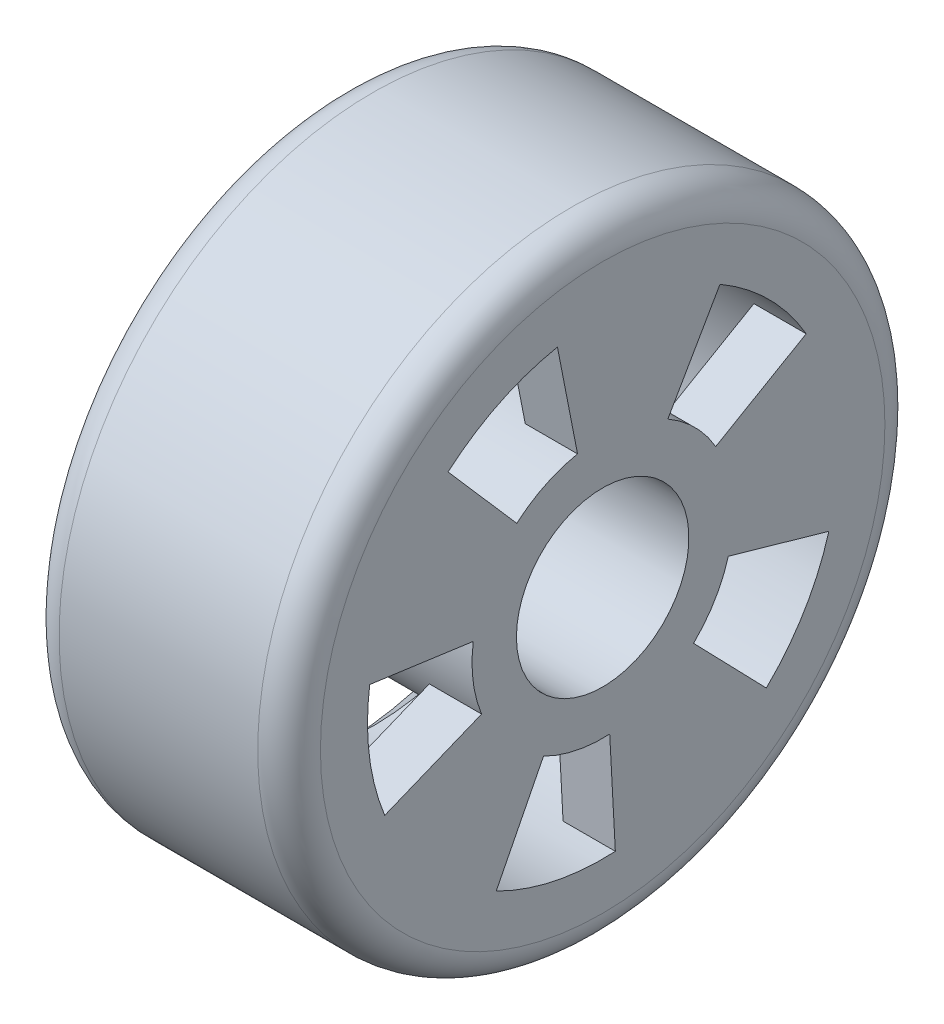
ISO-10303-21;
HEADER;
FILE_DESCRIPTION(('STEP AP214'),'2;1');
FILE_NAME('part.step','',(''),(''),'','','');
FILE_SCHEMA(('AUTOMOTIVE_DESIGN { 1 0 10303 214 1 1 1 1 }'));
ENDSEC;
DATA;
#1=APPLICATION_CONTEXT('core data for automotive mechanical design processes');
#2=APPLICATION_PROTOCOL_DEFINITION('international standard','automotive_design',2000,#1);
#3=PRODUCT_CONTEXT('',#1,'mechanical');
#4=PRODUCT('Part','Part','',(#3));
#5=PRODUCT_RELATED_PRODUCT_CATEGORY('part','',(#4));
#6=PRODUCT_DEFINITION_FORMATION('','',#4);
#7=PRODUCT_DEFINITION_CONTEXT('part definition',#1,'design');
#8=PRODUCT_DEFINITION('design','',#6,#7);
#9=PRODUCT_DEFINITION_SHAPE('','',#8);
#10=(LENGTH_UNIT() NAMED_UNIT(*) SI_UNIT(.MILLI.,.METRE.));
#11=(NAMED_UNIT(*) PLANE_ANGLE_UNIT() SI_UNIT($,.RADIAN.));
#12=(NAMED_UNIT(*) SI_UNIT($,.STERADIAN.) SOLID_ANGLE_UNIT());
#13=UNCERTAINTY_MEASURE_WITH_UNIT(LENGTH_MEASURE(1.E-05),#10,'distance_accuracy_value','');
#14=(GEOMETRIC_REPRESENTATION_CONTEXT(3) GLOBAL_UNCERTAINTY_ASSIGNED_CONTEXT((#13)) GLOBAL_UNIT_ASSIGNED_CONTEXT((#10,
#11,#12)) REPRESENTATION_CONTEXT('',''));
#15=CARTESIAN_POINT('',(0.,0.,0.));
#16=DIRECTION('',(0.,0.,1.));
#17=DIRECTION('',(1.,0.,0.));
#18=AXIS2_PLACEMENT_3D('',#15,#16,#17);
#19=CARTESIAN_POINT('',(25.,0.,0.));
#20=DIRECTION('',(-1.,0.,0.));
#21=DIRECTION('',(0.,0.,1.));
#22=AXIS2_PLACEMENT_3D('',#19,#20,#21);
#23=CYLINDRICAL_SURFACE('',#22,8.25);
#24=CARTESIAN_POINT('',(25.,0.,0.));
#25=DIRECTION('',(-1.,0.,0.));
#26=DIRECTION('',(0.,0.,1.));
#27=AXIS2_PLACEMENT_3D('',#24,#25,#26);
#28=CIRCLE('',#27,8.25);
#29=CARTESIAN_POINT('',(25.,0.,8.25));
#30=VERTEX_POINT('',#29);
#31=EDGE_CURVE('E521',#30,#30,#28,.T.);
#32=ORIENTED_EDGE('',*,*,#31,.F.);
#33=EDGE_LOOP('',(#32));
#34=FACE_BOUND('',#33,.T.);
#35=CARTESIAN_POINT('',(8.,0.,0.));
#36=DIRECTION('',(-1.,0.,0.));
#37=DIRECTION('',(0.,0.,1.));
#38=AXIS2_PLACEMENT_3D('',#35,#36,#37);
#39=CIRCLE('',#38,8.25);
#40=CARTESIAN_POINT('',(8.,0.,8.25));
#41=VERTEX_POINT('',#40);
#42=EDGE_CURVE('E11',#41,#41,#39,.F.);
#43=ORIENTED_EDGE('',*,*,#42,.F.);
#44=EDGE_LOOP('',(#43));
#45=FACE_BOUND('',#44,.T.);
#46=ADVANCED_FACE('F45',(#34,#45),#23,.F.);
#47=CARTESIAN_POINT('',(20.,0.,0.));
#48=DIRECTION('',(-1.,0.,0.));
#49=DIRECTION('',(0.,0.,1.));
#50=AXIS2_PLACEMENT_3D('',#47,#48,#49);
#51=PLANE('',#50);
#52=DIRECTION('',(0.,0.376047972262879,-0.926600195638322));
#53=VECTOR('',#52,1.);
#54=CARTESIAN_POINT('',(20.,0.,0.));
#55=LINE('',#54,#53);
#56=CARTESIAN_POINT('',(20.,-8.46107937591478,20.8485044018623));
#57=VERTEX_POINT('',#56);
#58=CARTESIAN_POINT('',(20.,-4.70059965328599,11.582502445479));
#59=VERTEX_POINT('',#58);
#60=EDGE_CURVE('E202',#57,#59,#55,.T.);
#61=ORIENTED_EDGE('',*,*,#60,.T.);
#62=CARTESIAN_POINT('',(20.,0.,0.));
#63=DIRECTION('',(-1.,0.,0.));
#64=DIRECTION('',(0.,0.,1.));
#65=AXIS2_PLACEMENT_3D('',#62,#63,#64);
#66=CIRCLE('',#65,12.5);
#67=CARTESIAN_POINT('',(20.,-11.146392898788,5.6575547143487));
#68=VERTEX_POINT('',#67);
#69=EDGE_CURVE('E215',#68,#59,#66,.T.);
#70=ORIENTED_EDGE('',*,*,#69,.F.);
#71=DIRECTION('',(0.,-0.891711431903038,0.452604377147895));
#72=VECTOR('',#71,1.);
#73=CARTESIAN_POINT('',(20.,0.,0.));
#74=LINE('',#73,#72);
#75=CARTESIAN_POINT('',(20.,-20.0635072178184,10.1835984858276));
#76=VERTEX_POINT('',#75);
#77=EDGE_CURVE('E333',#68,#76,#74,.T.);
#78=ORIENTED_EDGE('',*,*,#77,.T.);
#79=CARTESIAN_POINT('',(20.,0.,0.));
#80=DIRECTION('',(-1.,0.,0.));
#81=DIRECTION('',(0.,0.,1.));
#82=AXIS2_PLACEMENT_3D('',#79,#80,#81);
#83=CIRCLE('',#82,22.5);
#84=EDGE_CURVE('E417',#76,#57,#83,.T.);
#85=ORIENTED_EDGE('',*,*,#84,.T.);
#86=EDGE_LOOP('',(#61,#70,#78,#85));
#87=FACE_BOUND('',#86,.T.);
#88=ADVANCED_FACE('F443',(#87),#51,.T.);
#89=DIRECTION('',(0.,0.998546941446976,0.053888827477402));
#90=VECTOR('',#89,1.);
#91=CARTESIAN_POINT('',(20.,0.,0.));
#92=LINE('',#91,#90);
#93=CARTESIAN_POINT('',(20.,-22.467306182557,-1.21249861824155));
#94=VERTEX_POINT('',#93);
#95=CARTESIAN_POINT('',(20.,-12.4818367680872,-0.673610343467527));
#96=VERTEX_POINT('',#95);
#97=EDGE_CURVE('E337',#94,#96,#92,.T.);
#98=ORIENTED_EDGE('',*,*,#97,.T.);
#99=CARTESIAN_POINT('',(20.,-8.97823363979892,-8.69720188964147));
#100=VERTEX_POINT('',#99);
#101=EDGE_CURVE('E217',#100,#96,#66,.T.);
#102=ORIENTED_EDGE('',*,*,#101,.F.);
#103=DIRECTION('',(0.,-0.718258691183913,-0.695776151171318));
#104=VECTOR('',#103,1.);
#105=CARTESIAN_POINT('',(20.,0.,0.));
#106=LINE('',#105,#104);
#107=CARTESIAN_POINT('',(20.,-16.160820551638,-15.6549634013546));
#108=VERTEX_POINT('',#107);
#109=EDGE_CURVE('E242',#100,#108,#106,.T.);
#110=ORIENTED_EDGE('',*,*,#109,.T.);
#111=EDGE_CURVE('E386',#108,#94,#83,.T.);
#112=ORIENTED_EDGE('',*,*,#111,.T.);
#113=EDGE_LOOP('',(#98,#102,#110,#112));
#114=FACE_BOUND('',#113,.T.);
#115=ADVANCED_FACE('F449',(#114),#51,.T.);
#116=DIRECTION('',(0.,0.274142197468578,0.961689167853678));
#117=VECTOR('',#116,1.);
#118=CARTESIAN_POINT('',(20.,0.,0.));
#119=LINE('',#118,#117);
#120=CARTESIAN_POINT('',(20.,-6.16819944304301,-21.6380062767077));
#121=VERTEX_POINT('',#120);
#122=CARTESIAN_POINT('',(20.,-3.42677746835723,-12.021114598171));
#123=VERTEX_POINT('',#122);
#124=EDGE_CURVE('E329',#121,#123,#119,.T.);
#125=ORIENTED_EDGE('',*,*,#124,.T.);
#126=CARTESIAN_POINT('',(20.,6.2668265228017,-10.8155852977594));
#127=VERTEX_POINT('',#126);
#128=EDGE_CURVE('E209',#127,#123,#66,.T.);
#129=ORIENTED_EDGE('',*,*,#128,.F.);
#130=DIRECTION('',(0.,0.501346121824136,-0.865246823820751));
#131=VECTOR('',#130,1.);
#132=CARTESIAN_POINT('',(20.,0.,0.));
#133=LINE('',#132,#131);
#134=CARTESIAN_POINT('',(20.,11.2802877410431,-19.4680535359669));
#135=VERTEX_POINT('',#134);
#136=EDGE_CURVE('E410',#127,#135,#133,.T.);
#137=ORIENTED_EDGE('',*,*,#136,.T.);
#138=EDGE_CURVE('E381',#135,#121,#83,.T.);
#139=ORIENTED_EDGE('',*,*,#138,.T.);
#140=EDGE_LOOP('',(#125,#129,#137,#139));
#141=FACE_BOUND('',#140,.T.);
#142=ADVANCED_FACE('F508',(#141),#51,.T.);
#143=DIRECTION('',(0.,-0.866801889498882,0.498652669060507));
#144=VECTOR('',#143,1.);
#145=CARTESIAN_POINT('',(20.,0.,0.));
#146=LINE('',#145,#144);
#147=CARTESIAN_POINT('',(20.,19.5030425137248,-11.2196850538614));
#148=VERTEX_POINT('',#147);
#149=CARTESIAN_POINT('',(20.,10.835023618736,-6.23315836325634));
#150=VERTEX_POINT('',#149);
#151=EDGE_CURVE('E55',#148,#150,#146,.T.);
#152=ORIENTED_EDGE('',*,*,#151,.T.);
#153=CARTESIAN_POINT('',(20.,12.2666159503421,2.40419074260202));
#154=VERTEX_POINT('',#153);
#155=EDGE_CURVE('E187',#154,#150,#66,.T.);
#156=ORIENTED_EDGE('',*,*,#155,.F.);
#157=DIRECTION('',(0.,0.981329276027367,0.192335259408162));
#158=VECTOR('',#157,1.);
#159=CARTESIAN_POINT('',(20.,0.,0.));
#160=LINE('',#159,#158);
#161=CARTESIAN_POINT('',(20.,22.0799087106158,4.32754333668364));
#162=VERTEX_POINT('',#161);
#163=EDGE_CURVE('E196',#154,#162,#160,.T.);
#164=ORIENTED_EDGE('',*,*,#163,.T.);
#165=EDGE_CURVE('E380',#162,#148,#83,.T.);
#166=ORIENTED_EDGE('',*,*,#165,.T.);
#167=EDGE_LOOP('',(#152,#156,#164,#166));
#168=FACE_BOUND('',#167,.T.);
#169=ADVANCED_FACE('F205',(#168),#51,.T.);
#170=DIRECTION('',(0.,-0.753688452813014,-0.657231858704616));
#171=VECTOR('',#170,1.);
#172=CARTESIAN_POINT('',(20.,0.,0.));
#173=LINE('',#172,#171);
#174=CARTESIAN_POINT('',(20.,16.9579901882928,14.7877168208539));
#175=VERTEX_POINT('',#174);
#176=CARTESIAN_POINT('',(20.,9.42110566016268,8.21539823380771));
#177=VERTEX_POINT('',#176);
#178=EDGE_CURVE('E201',#175,#177,#173,.T.);
#179=ORIENTED_EDGE('',*,*,#178,.T.);
#180=CARTESIAN_POINT('',(20.,1.72041250997345,12.3810411838232));
#181=VERTEX_POINT('',#180);
#182=EDGE_CURVE('E208',#181,#177,#66,.T.);
#183=ORIENTED_EDGE('',*,*,#182,.F.);
#184=DIRECTION('',(0.,0.137633000797875,0.990483294705858));
#185=VECTOR('',#184,1.);
#186=CARTESIAN_POINT('',(20.,0.,0.));
#187=LINE('',#186,#185);
#188=CARTESIAN_POINT('',(20.,3.0967425179522,22.2858741308818));
#189=VERTEX_POINT('',#188);
#190=EDGE_CURVE('E341',#181,#189,#187,.T.);
#191=ORIENTED_EDGE('',*,*,#190,.T.);
#192=EDGE_CURVE('E420',#189,#175,#83,.T.);
#193=ORIENTED_EDGE('',*,*,#192,.T.);
#194=EDGE_LOOP('',(#179,#183,#191,#193));
#195=FACE_BOUND('',#194,.T.);
#196=ADVANCED_FACE('F451',(#195),#51,.T.);
#197=CARTESIAN_POINT('',(25.,0.,0.));
#198=DIRECTION('',(1.,0.,0.));
#199=DIRECTION('',(0.,0.,-1.));
#200=AXIS2_PLACEMENT_3D('',#197,#198,#199);
#201=PLANE('',#200);
#202=ORIENTED_EDGE('',*,*,#31,.T.);
#203=EDGE_LOOP('',(#202));
#204=FACE_BOUND('',#203,.T.);
#205=CARTESIAN_POINT('',(25.,0.,0.));
#206=DIRECTION('',(1.,0.,0.));
#207=DIRECTION('',(0.,0.,-1.));
#208=AXIS2_PLACEMENT_3D('',#205,#206,#207);
#209=CIRCLE('',#208,27.);
#210=CARTESIAN_POINT('',(25.,0.,-27.));
#211=VERTEX_POINT('',#210);
#212=EDGE_CURVE('E398',#211,#211,#209,.T.);
#213=ORIENTED_EDGE('',*,*,#212,.T.);
#214=EDGE_LOOP('',(#213));
#215=FACE_BOUND('',#214,.T.);
#216=DIRECTION('',(0.,-0.501346121824136,0.865246823820751));
#217=VECTOR('',#216,1.);
#218=CARTESIAN_POINT('',(25.,6.2668265228017,-10.8155852977594));
#219=LINE('',#218,#217);
#220=CARTESIAN_POINT('',(25.,11.2802877410431,-19.4680535359669));
#221=VERTEX_POINT('',#220);
#222=CARTESIAN_POINT('',(25.,6.26682652280169,-10.8155852977594));
#223=VERTEX_POINT('',#222);
#224=EDGE_CURVE('E363',#221,#223,#219,.T.);
#225=ORIENTED_EDGE('',*,*,#224,.T.);
#226=CARTESIAN_POINT('',(25.,0.,0.));
#227=DIRECTION('',(1.,0.,0.));
#228=DIRECTION('',(0.,0.,1.));
#229=AXIS2_PLACEMENT_3D('',#226,#227,#228);
#230=CIRCLE('',#229,12.5);
#231=CARTESIAN_POINT('',(25.,10.835023618736,-6.23315836325634));
#232=VERTEX_POINT('',#231);
#233=EDGE_CURVE('E351',#223,#232,#230,.T.);
#234=ORIENTED_EDGE('',*,*,#233,.T.);
#235=DIRECTION('',(0.,0.866801889498882,-0.498652669060507));
#236=VECTOR('',#235,1.);
#237=CARTESIAN_POINT('',(25.,10.835023618736,-6.23315836325634));
#238=LINE('',#237,#236);
#239=CARTESIAN_POINT('',(25.,19.5030425137248,-11.2196850538614));
#240=VERTEX_POINT('',#239);
#241=EDGE_CURVE('E355',#232,#240,#238,.T.);
#242=ORIENTED_EDGE('',*,*,#241,.T.);
#243=CARTESIAN_POINT('',(25.,0.,0.));
#244=DIRECTION('',(-1.,0.,0.));
#245=DIRECTION('',(0.,0.,1.));
#246=AXIS2_PLACEMENT_3D('',#243,#244,#245);
#247=CIRCLE('',#246,22.5);
#248=EDGE_CURVE('E359',#240,#221,#247,.T.);
#249=ORIENTED_EDGE('',*,*,#248,.T.);
#250=EDGE_LOOP('',(#225,#234,#242,#249));
#251=FACE_BOUND('',#250,.T.);
#252=DIRECTION('',(0.,0.718258691183913,0.695776151171318));
#253=VECTOR('',#252,1.);
#254=CARTESIAN_POINT('',(25.,-8.97823363979892,-8.69720188964147));
#255=LINE('',#254,#253);
#256=CARTESIAN_POINT('',(25.,-16.160820551638,-15.6549634013546));
#257=VERTEX_POINT('',#256);
#258=CARTESIAN_POINT('',(25.,-8.97823363979892,-8.69720188964147));
#259=VERTEX_POINT('',#258);
#260=EDGE_CURVE('E310',#257,#259,#255,.T.);
#261=ORIENTED_EDGE('',*,*,#260,.T.);
#262=CARTESIAN_POINT('',(25.,0.,0.));
#263=DIRECTION('',(1.,0.,0.));
#264=DIRECTION('',(0.,0.970295726275995,0.241921895599675));
#265=AXIS2_PLACEMENT_3D('',#262,#263,#264);
#266=CIRCLE('',#265,12.5);
#267=CARTESIAN_POINT('',(25.,-3.42677746835723,-12.021114598171));
#268=VERTEX_POINT('',#267);
#269=EDGE_CURVE('E298',#259,#268,#266,.T.);
#270=ORIENTED_EDGE('',*,*,#269,.T.);
#271=DIRECTION('',(0.,-0.274142197468578,-0.961689167853678));
#272=VECTOR('',#271,1.);
#273=CARTESIAN_POINT('',(25.,-3.42677746835723,-12.021114598171));
#274=LINE('',#273,#272);
#275=CARTESIAN_POINT('',(25.,-6.16819944304301,-21.6380062767077));
#276=VERTEX_POINT('',#275);
#277=EDGE_CURVE('E302',#268,#276,#274,.T.);
#278=ORIENTED_EDGE('',*,*,#277,.T.);
#279=CARTESIAN_POINT('',(25.,0.,0.));
#280=DIRECTION('',(-1.,0.,0.));
#281=DIRECTION('',(0.,0.970295726275995,0.241921895599675));
#282=AXIS2_PLACEMENT_3D('',#279,#280,#281);
#283=CIRCLE('',#282,22.5);
#284=EDGE_CURVE('E306',#276,#257,#283,.T.);
#285=ORIENTED_EDGE('',*,*,#284,.T.);
#286=EDGE_LOOP('',(#261,#270,#278,#285));
#287=FACE_BOUND('',#286,.T.);
#288=DIRECTION('',(0.,0.891711431903038,-0.452604377147895));
#289=VECTOR('',#288,1.);
#290=CARTESIAN_POINT('',(25.,-11.146392898788,5.6575547143487));
#291=LINE('',#290,#289);
#292=CARTESIAN_POINT('',(25.,-20.0635072178183,10.1835984858276));
#293=VERTEX_POINT('',#292);
#294=CARTESIAN_POINT('',(25.,-11.146392898788,5.6575547143487));
#295=VERTEX_POINT('',#294);
#296=EDGE_CURVE('E282',#293,#295,#291,.T.);
#297=ORIENTED_EDGE('',*,*,#296,.T.);
#298=CARTESIAN_POINT('',(25.,0.,0.));
#299=DIRECTION('',(1.,0.,0.));
#300=DIRECTION('',(0.,0.544639035015032,-0.838670567945421));
#301=AXIS2_PLACEMENT_3D('',#298,#299,#300);
#302=CIRCLE('',#301,12.5);
#303=CARTESIAN_POINT('',(25.,-12.4818367680872,-0.673610343467527));
#304=VERTEX_POINT('',#303);
#305=EDGE_CURVE('E269',#295,#304,#302,.T.);
#306=ORIENTED_EDGE('',*,*,#305,.T.);
#307=DIRECTION('',(0.,-0.998546941446976,-0.053888827477402));
#308=VECTOR('',#307,1.);
#309=CARTESIAN_POINT('',(25.,-12.4818367680872,-0.673610343467527));
#310=LINE('',#309,#308);
#311=CARTESIAN_POINT('',(25.,-22.467306182557,-1.21249861824155));
#312=VERTEX_POINT('',#311);
#313=EDGE_CURVE('E273',#304,#312,#310,.T.);
#314=ORIENTED_EDGE('',*,*,#313,.T.);
#315=CARTESIAN_POINT('',(25.,0.,0.));
#316=DIRECTION('',(-1.,0.,0.));
#317=DIRECTION('',(0.,0.544639035015032,-0.838670567945421));
#318=AXIS2_PLACEMENT_3D('',#315,#316,#317);
#319=CIRCLE('',#318,22.5);
#320=EDGE_CURVE('E278',#312,#293,#319,.T.);
#321=ORIENTED_EDGE('',*,*,#320,.T.);
#322=EDGE_LOOP('',(#297,#306,#314,#321));
#323=FACE_BOUND('',#322,.T.);
#324=DIRECTION('',(0.,-0.137633000797875,-0.990483294705858));
#325=VECTOR('',#324,1.);
#326=CARTESIAN_POINT('',(25.,1.72041250997345,12.3810411838232));
#327=LINE('',#326,#325);
#328=CARTESIAN_POINT('',(25.,3.0967425179522,22.2858741308818));
#329=VERTEX_POINT('',#328);
#330=CARTESIAN_POINT('',(25.,1.72041250997345,12.3810411838232));
#331=VERTEX_POINT('',#330);
#332=EDGE_CURVE('E254',#329,#331,#327,.T.);
#333=ORIENTED_EDGE('',*,*,#332,.T.);
#334=CARTESIAN_POINT('',(25.,0.,0.));
#335=DIRECTION('',(1.,0.,0.));
#336=DIRECTION('',(0.,-0.615661475325655,-0.788010753606724));
#337=AXIS2_PLACEMENT_3D('',#334,#335,#336);
#338=CIRCLE('',#337,12.5);
#339=CARTESIAN_POINT('',(25.,-4.70059965328599,11.582502445479));
#340=VERTEX_POINT('',#339);
#341=EDGE_CURVE('E69',#331,#340,#338,.T.);
#342=ORIENTED_EDGE('',*,*,#341,.T.);
#343=DIRECTION('',(0.,-0.376047972262879,0.926600195638322));
#344=VECTOR('',#343,1.);
#345=CARTESIAN_POINT('',(25.,-4.70059965328599,11.582502445479));
#346=LINE('',#345,#344);
#347=CARTESIAN_POINT('',(25.,-8.46107937591478,20.8485044018623));
#348=VERTEX_POINT('',#347);
#349=EDGE_CURVE('E245',#340,#348,#346,.T.);
#350=ORIENTED_EDGE('',*,*,#349,.T.);
#351=CARTESIAN_POINT('',(25.,0.,0.));
#352=DIRECTION('',(-1.,0.,0.));
#353=DIRECTION('',(0.,-0.615661475325655,-0.788010753606724));
#354=AXIS2_PLACEMENT_3D('',#351,#352,#353);
#355=CIRCLE('',#354,22.5);
#356=EDGE_CURVE('E250',#348,#329,#355,.T.);
#357=ORIENTED_EDGE('',*,*,#356,.T.);
#358=EDGE_LOOP('',(#333,#342,#350,#357));
#359=FACE_BOUND('',#358,.T.);
#360=DIRECTION('',(0.,-0.981329276027366,-0.192335259408162));
#361=VECTOR('',#360,1.);
#362=CARTESIAN_POINT('',(25.,12.2666159503421,2.40419074260202));
#363=LINE('',#362,#361);
#364=CARTESIAN_POINT('',(25.,22.0799087106157,4.32754333668363));
#365=VERTEX_POINT('',#364);
#366=CARTESIAN_POINT('',(25.,12.2666159503421,2.40419074260202));
#367=VERTEX_POINT('',#366);
#368=EDGE_CURVE('E193',#365,#367,#363,.T.);
#369=ORIENTED_EDGE('',*,*,#368,.T.);
#370=CARTESIAN_POINT('',(25.,0.,0.));
#371=DIRECTION('',(1.,0.,0.));
#372=DIRECTION('',(0.,-0.945518575599317,0.325568154457155));
#373=AXIS2_PLACEMENT_3D('',#370,#371,#372);
#374=CIRCLE('',#373,12.5);
#375=CARTESIAN_POINT('',(25.,9.42110566016268,8.21539823380771));
#376=VERTEX_POINT('',#375);
#377=EDGE_CURVE('E62',#367,#376,#374,.T.);
#378=ORIENTED_EDGE('',*,*,#377,.T.);
#379=DIRECTION('',(0.,0.753688452813014,0.657231858704616));
#380=VECTOR('',#379,1.);
#381=CARTESIAN_POINT('',(25.,9.42110566016268,8.21539823380771));
#382=LINE('',#381,#380);
#383=CARTESIAN_POINT('',(25.,16.9579901882928,14.7877168208539));
#384=VERTEX_POINT('',#383);
#385=EDGE_CURVE('E223',#376,#384,#382,.T.);
#386=ORIENTED_EDGE('',*,*,#385,.T.);
#387=CARTESIAN_POINT('',(25.,0.,0.));
#388=DIRECTION('',(-1.,0.,0.));
#389=DIRECTION('',(0.,-0.945518575599317,0.325568154457155));
#390=AXIS2_PLACEMENT_3D('',#387,#388,#389);
#391=CIRCLE('',#390,22.5);
#392=EDGE_CURVE('E228',#384,#365,#391,.T.);
#393=ORIENTED_EDGE('',*,*,#392,.T.);
#394=EDGE_LOOP('',(#369,#378,#386,#393));
#395=FACE_BOUND('',#394,.T.);
#396=ADVANCED_FACE('F498',(#204,#215,#251,#287,#323,#359,#395),#201,.T.);
#397=CARTESIAN_POINT('',(25.,0.,0.));
#398=DIRECTION('',(-1.,0.,0.));
#399=DIRECTION('',(0.,0.,1.));
#400=AXIS2_PLACEMENT_3D('',#397,#398,#399);
#401=CYLINDRICAL_SURFACE('',#400,30.);
#402=CARTESIAN_POINT('',(3.,0.,0.));
#403=DIRECTION('',(1.,0.,0.));
#404=DIRECTION('',(0.,0.,-1.));
#405=AXIS2_PLACEMENT_3D('',#402,#403,#404);
#406=CIRCLE('',#405,30.);
#407=CARTESIAN_POINT('',(3.,0.,-30.));
#408=VERTEX_POINT('',#407);
#409=EDGE_CURVE('E390',#408,#408,#406,.T.);
#410=ORIENTED_EDGE('',*,*,#409,.T.);
#411=EDGE_LOOP('',(#410));
#412=FACE_BOUND('',#411,.T.);
#413=CARTESIAN_POINT('',(22.,0.,0.));
#414=DIRECTION('',(1.,0.,0.));
#415=DIRECTION('',(0.,0.,-1.));
#416=AXIS2_PLACEMENT_3D('',#413,#414,#415);
#417=CIRCLE('',#416,30.);
#418=CARTESIAN_POINT('',(22.,0.,-30.));
#419=VERTEX_POINT('',#418);
#420=EDGE_CURVE('E385',#419,#419,#417,.F.);
#421=ORIENTED_EDGE('',*,*,#420,.T.);
#422=EDGE_LOOP('',(#421));
#423=FACE_BOUND('',#422,.T.);
#424=ADVANCED_FACE('F707',(#412,#423),#401,.T.);
#425=CARTESIAN_POINT('',(0.,0.,0.));
#426=DIRECTION('',(1.,0.,0.));
#427=DIRECTION('',(0.,0.,-1.));
#428=AXIS2_PLACEMENT_3D('',#425,#426,#427);
#429=PLANE('',#428);
#430=CARTESIAN_POINT('',(0.,0.,0.));
#431=DIRECTION('',(1.,0.,0.));
#432=DIRECTION('',(0.,0.,-1.));
#433=AXIS2_PLACEMENT_3D('',#430,#431,#432);
#434=CIRCLE('',#433,25.5);
#435=CARTESIAN_POINT('',(0.,0.,-25.5));
#436=VERTEX_POINT('',#435);
#437=EDGE_CURVE('E406',#436,#436,#434,.T.);
#438=ORIENTED_EDGE('',*,*,#437,.T.);
#439=EDGE_LOOP('',(#438));
#440=FACE_BOUND('',#439,.T.);
#441=CARTESIAN_POINT('',(0.,0.,0.));
#442=DIRECTION('',(1.,0.,0.));
#443=DIRECTION('',(0.,0.,-1.));
#444=AXIS2_PLACEMENT_3D('',#441,#442,#443);
#445=CIRCLE('',#444,27.);
#446=CARTESIAN_POINT('',(0.,0.,-27.));
#447=VERTEX_POINT('',#446);
#448=EDGE_CURVE('E394',#447,#447,#445,.F.);
#449=ORIENTED_EDGE('',*,*,#448,.T.);
#450=EDGE_LOOP('',(#449));
#451=FACE_BOUND('',#450,.T.);
#452=ADVANCED_FACE('F701',(#440,#451),#429,.F.);
#453=CARTESIAN_POINT('',(3.,0.,0.));
#454=DIRECTION('',(1.,0.,0.));
#455=DIRECTION('',(0.,0.,-1.));
#456=AXIS2_PLACEMENT_3D('',#453,#454,#455);
#457=TOROIDAL_SURFACE('',#456,27.,3.);
#458=ORIENTED_EDGE('',*,*,#448,.F.);
#459=EDGE_LOOP('',(#458));
#460=FACE_BOUND('',#459,.T.);
#461=ORIENTED_EDGE('',*,*,#409,.F.);
#462=EDGE_LOOP('',(#461));
#463=FACE_BOUND('',#462,.T.);
#464=ADVANCED_FACE('F706',(#460,#463),#457,.T.);
#465=CARTESIAN_POINT('',(22.,0.,0.));
#466=DIRECTION('',(1.,0.,0.));
#467=DIRECTION('',(0.,0.,-1.));
#468=AXIS2_PLACEMENT_3D('',#465,#466,#467);
#469=TOROIDAL_SURFACE('',#468,27.,3.);
#470=ORIENTED_EDGE('',*,*,#420,.F.);
#471=EDGE_LOOP('',(#470));
#472=FACE_BOUND('',#471,.T.);
#473=ORIENTED_EDGE('',*,*,#212,.F.);
#474=EDGE_LOOP('',(#473));
#475=FACE_BOUND('',#474,.T.);
#476=ADVANCED_FACE('F678',(#472,#475),#469,.T.);
#477=CARTESIAN_POINT('',(20.,0.,0.));
#478=DIRECTION('',(-1.,0.,0.));
#479=DIRECTION('',(0.,0.,1.));
#480=AXIS2_PLACEMENT_3D('',#477,#478,#479);
#481=CYLINDRICAL_SURFACE('',#480,22.5);
#482=CARTESIAN_POINT('',(3.,0.,0.));
#483=DIRECTION('',(1.,0.,0.));
#484=DIRECTION('',(0.,0.,-1.));
#485=AXIS2_PLACEMENT_3D('',#482,#483,#484);
#486=CIRCLE('',#485,22.5);
#487=CARTESIAN_POINT('',(3.,0.,-22.5));
#488=VERTEX_POINT('',#487);
#489=EDGE_CURVE('E402',#488,#488,#486,.F.);
#490=ORIENTED_EDGE('',*,*,#489,.T.);
#491=EDGE_LOOP('',(#490));
#492=FACE_BOUND('',#491,.T.);
#493=ORIENTED_EDGE('',*,*,#111,.F.);
#494=DIRECTION('',(1.,0.,0.));
#495=VECTOR('',#494,1.);
#496=CARTESIAN_POINT('',(0.,-16.160820551638,-15.6549634013546));
#497=LINE('',#496,#495);
#498=EDGE_CURVE('E318',#108,#257,#497,.T.);
#499=ORIENTED_EDGE('',*,*,#498,.T.);
#500=ORIENTED_EDGE('',*,*,#284,.F.);
#501=DIRECTION('',(1.,0.,0.));
#502=VECTOR('',#501,1.);
#503=CARTESIAN_POINT('',(0.,-6.16819944304301,-21.6380062767077));
#504=LINE('',#503,#502);
#505=EDGE_CURVE('E321',#121,#276,#504,.T.);
#506=ORIENTED_EDGE('',*,*,#505,.F.);
#507=ORIENTED_EDGE('',*,*,#138,.F.);
#508=DIRECTION('',(1.,0.,0.));
#509=VECTOR('',#508,1.);
#510=CARTESIAN_POINT('',(0.,11.2802877410431,-19.4680535359669));
#511=LINE('',#510,#509);
#512=EDGE_CURVE('E371',#135,#221,#511,.T.);
#513=ORIENTED_EDGE('',*,*,#512,.T.);
#514=ORIENTED_EDGE('',*,*,#248,.F.);
#515=DIRECTION('',(1.,0.,0.));
#516=VECTOR('',#515,1.);
#517=CARTESIAN_POINT('',(0.,19.5030425137248,-11.2196850538614));
#518=LINE('',#517,#516);
#519=EDGE_CURVE('E374',#148,#240,#518,.T.);
#520=ORIENTED_EDGE('',*,*,#519,.F.);
#521=ORIENTED_EDGE('',*,*,#165,.F.);
#522=DIRECTION('',(1.,0.,0.));
#523=VECTOR('',#522,1.);
#524=CARTESIAN_POINT('',(0.,22.0799087106157,4.32754333668363));
#525=LINE('',#524,#523);
#526=EDGE_CURVE('E192',#162,#365,#525,.T.);
#527=ORIENTED_EDGE('',*,*,#526,.T.);
#528=ORIENTED_EDGE('',*,*,#392,.F.);
#529=DIRECTION('',(1.,0.,0.));
#530=VECTOR('',#529,1.);
#531=CARTESIAN_POINT('',(0.,16.9579901882928,14.7877168208539));
#532=LINE('',#531,#530);
#533=EDGE_CURVE('E236',#175,#384,#532,.T.);
#534=ORIENTED_EDGE('',*,*,#533,.F.);
#535=ORIENTED_EDGE('',*,*,#192,.F.);
#536=DIRECTION('',(1.,0.,0.));
#537=VECTOR('',#536,1.);
#538=CARTESIAN_POINT('',(0.,3.0967425179522,22.2858741308818));
#539=LINE('',#538,#537);
#540=EDGE_CURVE('E261',#189,#329,#539,.T.);
#541=ORIENTED_EDGE('',*,*,#540,.T.);
#542=ORIENTED_EDGE('',*,*,#356,.F.);
#543=DIRECTION('',(1.,0.,0.));
#544=VECTOR('',#543,1.);
#545=CARTESIAN_POINT('',(0.,-8.46107937591478,20.8485044018623));
#546=LINE('',#545,#544);
#547=EDGE_CURVE('E264',#57,#348,#546,.T.);
#548=ORIENTED_EDGE('',*,*,#547,.F.);
#549=ORIENTED_EDGE('',*,*,#84,.F.);
#550=DIRECTION('',(1.,0.,0.));
#551=VECTOR('',#550,1.);
#552=CARTESIAN_POINT('',(0.,-20.0635072178183,10.1835984858276));
#553=LINE('',#552,#551);
#554=EDGE_CURVE('E290',#76,#293,#553,.T.);
#555=ORIENTED_EDGE('',*,*,#554,.T.);
#556=ORIENTED_EDGE('',*,*,#320,.F.);
#557=DIRECTION('',(1.,0.,0.));
#558=VECTOR('',#557,1.);
#559=CARTESIAN_POINT('',(0.,-22.467306182557,-1.21249861824155));
#560=LINE('',#559,#558);
#561=EDGE_CURVE('E293',#94,#312,#560,.T.);
#562=ORIENTED_EDGE('',*,*,#561,.F.);
#563=EDGE_LOOP('',(#493,#499,#500,#506,#507,#513,#514,#520,#521,#527,#528,#534,#535,#541,#542,
#548,#549,#555,#556,#562));
#564=FACE_BOUND('',#563,.T.);
#565=ADVANCED_FACE('F439',(#492,#564),#481,.F.);
#566=CARTESIAN_POINT('',(3.,0.,0.));
#567=DIRECTION('',(-1.,0.,0.));
#568=DIRECTION('',(0.,0.,1.));
#569=AXIS2_PLACEMENT_3D('',#566,#567,#568);
#570=CONICAL_SURFACE('',#569,22.5,0.785398163397448);
#571=ORIENTED_EDGE('',*,*,#437,.F.);
#572=EDGE_LOOP('',(#571));
#573=FACE_BOUND('',#572,.T.);
#574=ORIENTED_EDGE('',*,*,#489,.F.);
#575=EDGE_LOOP('',(#574));
#576=FACE_BOUND('',#575,.T.);
#577=ADVANCED_FACE('F48',(#573,#576),#570,.F.);
#578=CARTESIAN_POINT('',(0.,0.,0.));
#579=DIRECTION('',(1.,0.,0.));
#580=DIRECTION('',(0.,0.,-1.));
#581=AXIS2_PLACEMENT_3D('',#578,#579,#580);
#582=CYLINDRICAL_SURFACE('',#581,12.5);
#583=DIRECTION('',(1.,0.,0.));
#584=VECTOR('',#583,1.);
#585=CARTESIAN_POINT('',(0.,10.835023618736,-6.23315836325634));
#586=LINE('',#585,#584);
#587=EDGE_CURVE('E377',#150,#232,#586,.T.);
#588=ORIENTED_EDGE('',*,*,#587,.T.);
#589=ORIENTED_EDGE('',*,*,#233,.F.);
#590=DIRECTION('',(1.,0.,0.));
#591=VECTOR('',#590,1.);
#592=CARTESIAN_POINT('',(0.,6.2668265228017,-10.8155852977594));
#593=LINE('',#592,#591);
#594=EDGE_CURVE('E367',#127,#223,#593,.T.);
#595=ORIENTED_EDGE('',*,*,#594,.F.);
#596=ORIENTED_EDGE('',*,*,#128,.T.);
#597=DIRECTION('',(1.,0.,0.));
#598=VECTOR('',#597,1.);
#599=CARTESIAN_POINT('',(0.,-3.42677746835723,-12.021114598171));
#600=LINE('',#599,#598);
#601=EDGE_CURVE('E274',#123,#268,#600,.T.);
#602=ORIENTED_EDGE('',*,*,#601,.T.);
#603=ORIENTED_EDGE('',*,*,#269,.F.);
#604=DIRECTION('',(1.,0.,0.));
#605=VECTOR('',#604,1.);
#606=CARTESIAN_POINT('',(0.,-8.97823363979892,-8.69720188964147));
#607=LINE('',#606,#605);
#608=EDGE_CURVE('E314',#100,#259,#607,.T.);
#609=ORIENTED_EDGE('',*,*,#608,.F.);
#610=ORIENTED_EDGE('',*,*,#101,.T.);
#611=DIRECTION('',(1.,0.,0.));
#612=VECTOR('',#611,1.);
#613=CARTESIAN_POINT('',(0.,-12.4818367680872,-0.673610343467527));
#614=LINE('',#613,#612);
#615=EDGE_CURVE('E246',#96,#304,#614,.T.);
#616=ORIENTED_EDGE('',*,*,#615,.T.);
#617=ORIENTED_EDGE('',*,*,#305,.F.);
#618=DIRECTION('',(1.,0.,0.));
#619=VECTOR('',#618,1.);
#620=CARTESIAN_POINT('',(0.,-11.146392898788,5.6575547143487));
#621=LINE('',#620,#619);
#622=EDGE_CURVE('E286',#68,#295,#621,.T.);
#623=ORIENTED_EDGE('',*,*,#622,.F.);
#624=ORIENTED_EDGE('',*,*,#69,.T.);
#625=DIRECTION('',(1.,0.,0.));
#626=VECTOR('',#625,1.);
#627=CARTESIAN_POINT('',(0.,-4.70059965328599,11.582502445479));
#628=LINE('',#627,#626);
#629=EDGE_CURVE('E224',#59,#340,#628,.T.);
#630=ORIENTED_EDGE('',*,*,#629,.T.);
#631=ORIENTED_EDGE('',*,*,#341,.F.);
#632=DIRECTION('',(1.,0.,0.));
#633=VECTOR('',#632,1.);
#634=CARTESIAN_POINT('',(0.,1.72041250997345,12.3810411838232));
#635=LINE('',#634,#633);
#636=EDGE_CURVE('E258',#181,#331,#635,.T.);
#637=ORIENTED_EDGE('',*,*,#636,.F.);
#638=ORIENTED_EDGE('',*,*,#182,.T.);
#639=DIRECTION('',(1.,0.,0.));
#640=VECTOR('',#639,1.);
#641=CARTESIAN_POINT('',(0.,9.42110566016268,8.21539823380771));
#642=LINE('',#641,#640);
#643=EDGE_CURVE('E239',#177,#376,#642,.T.);
#644=ORIENTED_EDGE('',*,*,#643,.T.);
#645=ORIENTED_EDGE('',*,*,#377,.F.);
#646=DIRECTION('',(1.,0.,0.));
#647=VECTOR('',#646,1.);
#648=CARTESIAN_POINT('',(0.,12.2666159503421,2.40419074260202));
#649=LINE('',#648,#647);
#650=EDGE_CURVE('E182',#154,#367,#649,.T.);
#651=ORIENTED_EDGE('',*,*,#650,.F.);
#652=ORIENTED_EDGE('',*,*,#155,.T.);
#653=EDGE_LOOP('',(#588,#589,#595,#596,#602,#603,#609,#610,#616,#617,#623,#624,#630,#631,#637,
#638,#644,#645,#651,#652));
#654=FACE_BOUND('',#653,.T.);
#655=CARTESIAN_POINT('',(5.,0.,0.));
#656=DIRECTION('',(-1.,0.,0.));
#657=DIRECTION('',(0.,0.,1.));
#658=AXIS2_PLACEMENT_3D('',#655,#656,#657);
#659=CIRCLE('',#658,12.5);
#660=CARTESIAN_POINT('',(5.,0.,12.5));
#661=VERTEX_POINT('',#660);
#662=EDGE_CURVE('E214',#661,#661,#659,.T.);
#663=ORIENTED_EDGE('',*,*,#662,.F.);
#664=EDGE_LOOP('',(#663));
#665=FACE_BOUND('',#664,.T.);
#666=ADVANCED_FACE('F184',(#654,#665),#582,.T.);
#667=CARTESIAN_POINT('',(0.,10.835023618736,-6.23315836325634));
#668=DIRECTION('',(0.,-0.498652669060507,-0.866801889498882));
#669=DIRECTION('',(0.,0.866801889498882,-0.498652669060507));
#670=AXIS2_PLACEMENT_3D('',#667,#668,#669);
#671=PLANE('',#670);
#672=ORIENTED_EDGE('',*,*,#519,.T.);
#673=ORIENTED_EDGE('',*,*,#241,.F.);
#674=ORIENTED_EDGE('',*,*,#587,.F.);
#675=ORIENTED_EDGE('',*,*,#151,.F.);
#676=EDGE_LOOP('',(#672,#673,#674,#675));
#677=FACE_BOUND('',#676,.T.);
#678=ADVANCED_FACE('F430',(#677),#671,.T.);
#679=CARTESIAN_POINT('',(0.,6.2668265228017,-10.8155852977594));
#680=DIRECTION('',(0.,0.865246823820751,0.501346121824136));
#681=DIRECTION('',(0.,-0.501346121824136,0.865246823820751));
#682=AXIS2_PLACEMENT_3D('',#679,#680,#681);
#683=PLANE('',#682);
#684=ORIENTED_EDGE('',*,*,#594,.T.);
#685=ORIENTED_EDGE('',*,*,#224,.F.);
#686=ORIENTED_EDGE('',*,*,#512,.F.);
#687=ORIENTED_EDGE('',*,*,#136,.F.);
#688=EDGE_LOOP('',(#684,#685,#686,#687));
#689=FACE_BOUND('',#688,.T.);
#690=ADVANCED_FACE('F436',(#689),#683,.T.);
#691=CARTESIAN_POINT('',(0.,-3.42677746835723,-12.021114598171));
#692=DIRECTION('',(0.,-0.961689167853678,0.274142197468578));
#693=DIRECTION('',(0.,-0.274142197468578,-0.961689167853678));
#694=AXIS2_PLACEMENT_3D('',#691,#692,#693);
#695=PLANE('',#694);
#696=ORIENTED_EDGE('',*,*,#505,.T.);
#697=ORIENTED_EDGE('',*,*,#277,.F.);
#698=ORIENTED_EDGE('',*,*,#601,.F.);
#699=ORIENTED_EDGE('',*,*,#124,.F.);
#700=EDGE_LOOP('',(#696,#697,#698,#699));
#701=FACE_BOUND('',#700,.T.);
#702=ADVANCED_FACE('F485',(#701),#695,.T.);
#703=CARTESIAN_POINT('',(0.,-8.97823363979892,-8.69720188964147));
#704=DIRECTION('',(0.,0.695776151171318,-0.718258691183913));
#705=DIRECTION('',(0.,0.718258691183913,0.695776151171318));
#706=AXIS2_PLACEMENT_3D('',#703,#704,#705);
#707=PLANE('',#706);
#708=ORIENTED_EDGE('',*,*,#608,.T.);
#709=ORIENTED_EDGE('',*,*,#260,.F.);
#710=ORIENTED_EDGE('',*,*,#498,.F.);
#711=ORIENTED_EDGE('',*,*,#109,.F.);
#712=EDGE_LOOP('',(#708,#709,#710,#711));
#713=FACE_BOUND('',#712,.T.);
#714=ADVANCED_FACE('F481',(#713),#707,.T.);
#715=CARTESIAN_POINT('',(0.,-12.4818367680872,-0.673610343467527));
#716=DIRECTION('',(0.,-0.053888827477402,0.998546941446976));
#717=DIRECTION('',(0.,-0.998546941446976,-0.053888827477402));
#718=AXIS2_PLACEMENT_3D('',#715,#716,#717);
#719=PLANE('',#718);
#720=ORIENTED_EDGE('',*,*,#561,.T.);
#721=ORIENTED_EDGE('',*,*,#313,.F.);
#722=ORIENTED_EDGE('',*,*,#615,.F.);
#723=ORIENTED_EDGE('',*,*,#97,.F.);
#724=EDGE_LOOP('',(#720,#721,#722,#723));
#725=FACE_BOUND('',#724,.T.);
#726=ADVANCED_FACE('F477',(#725),#719,.T.);
#727=CARTESIAN_POINT('',(0.,-11.146392898788,5.6575547143487));
#728=DIRECTION('',(0.,-0.452604377147895,-0.891711431903038));
#729=DIRECTION('',(0.,0.891711431903038,-0.452604377147895));
#730=AXIS2_PLACEMENT_3D('',#727,#728,#729);
#731=PLANE('',#730);
#732=ORIENTED_EDGE('',*,*,#622,.T.);
#733=ORIENTED_EDGE('',*,*,#296,.F.);
#734=ORIENTED_EDGE('',*,*,#554,.F.);
#735=ORIENTED_EDGE('',*,*,#77,.F.);
#736=EDGE_LOOP('',(#732,#733,#734,#735));
#737=FACE_BOUND('',#736,.T.);
#738=ADVANCED_FACE('F473',(#737),#731,.T.);
#739=CARTESIAN_POINT('',(0.,-4.70059965328599,11.582502445479));
#740=DIRECTION('',(0.,0.926600195638322,0.376047972262879));
#741=DIRECTION('',(0.,-0.376047972262879,0.926600195638322));
#742=AXIS2_PLACEMENT_3D('',#739,#740,#741);
#743=PLANE('',#742);
#744=ORIENTED_EDGE('',*,*,#547,.T.);
#745=ORIENTED_EDGE('',*,*,#349,.F.);
#746=ORIENTED_EDGE('',*,*,#629,.F.);
#747=ORIENTED_EDGE('',*,*,#60,.F.);
#748=EDGE_LOOP('',(#744,#745,#746,#747));
#749=FACE_BOUND('',#748,.T.);
#750=ADVANCED_FACE('F469',(#749),#743,.T.);
#751=CARTESIAN_POINT('',(0.,1.72041250997345,12.3810411838232));
#752=DIRECTION('',(0.,-0.990483294705858,0.137633000797875));
#753=DIRECTION('',(0.,-0.137633000797875,-0.990483294705858));
#754=AXIS2_PLACEMENT_3D('',#751,#752,#753);
#755=PLANE('',#754);
#756=ORIENTED_EDGE('',*,*,#636,.T.);
#757=ORIENTED_EDGE('',*,*,#332,.F.);
#758=ORIENTED_EDGE('',*,*,#540,.F.);
#759=ORIENTED_EDGE('',*,*,#190,.F.);
#760=EDGE_LOOP('',(#756,#757,#758,#759));
#761=FACE_BOUND('',#760,.T.);
#762=ADVANCED_FACE('F465',(#761),#755,.T.);
#763=CARTESIAN_POINT('',(0.,9.42110566016268,8.21539823380771));
#764=DIRECTION('',(0.,0.657231858704616,-0.753688452813014));
#765=DIRECTION('',(0.,0.753688452813014,0.657231858704616));
#766=AXIS2_PLACEMENT_3D('',#763,#764,#765);
#767=PLANE('',#766);
#768=ORIENTED_EDGE('',*,*,#533,.T.);
#769=ORIENTED_EDGE('',*,*,#385,.F.);
#770=ORIENTED_EDGE('',*,*,#643,.F.);
#771=ORIENTED_EDGE('',*,*,#178,.F.);
#772=EDGE_LOOP('',(#768,#769,#770,#771));
#773=FACE_BOUND('',#772,.T.);
#774=ADVANCED_FACE('F462',(#773),#767,.T.);
#775=CARTESIAN_POINT('',(0.,12.2666159503421,2.40419074260202));
#776=DIRECTION('',(0.,-0.192335259408162,0.981329276027366));
#777=DIRECTION('',(0.,-0.981329276027367,-0.192335259408162));
#778=AXIS2_PLACEMENT_3D('',#775,#776,#777);
#779=PLANE('',#778);
#780=ORIENTED_EDGE('',*,*,#650,.T.);
#781=ORIENTED_EDGE('',*,*,#368,.F.);
#782=ORIENTED_EDGE('',*,*,#526,.F.);
#783=ORIENTED_EDGE('',*,*,#163,.F.);
#784=EDGE_LOOP('',(#780,#781,#782,#783));
#785=FACE_BOUND('',#784,.T.);
#786=ADVANCED_FACE('F197',(#785),#779,.T.);
#787=CARTESIAN_POINT('',(5.,0.,0.));
#788=DIRECTION('',(-1.,0.,0.));
#789=DIRECTION('',(0.,0.,1.));
#790=AXIS2_PLACEMENT_3D('',#787,#788,#789);
#791=PLANE('',#790);
#792=ORIENTED_EDGE('',*,*,#662,.T.);
#793=EDGE_LOOP('',(#792));
#794=FACE_BOUND('',#793,.T.);
#795=CARTESIAN_POINT('',(5.,0.,0.));
#796=DIRECTION('',(-1.,0.,0.));
#797=DIRECTION('',(0.,0.,1.));
#798=AXIS2_PLACEMENT_3D('',#795,#796,#797);
#799=CIRCLE('',#798,5.);
#800=CARTESIAN_POINT('',(5.,0.,5.));
#801=VERTEX_POINT('',#800);
#802=EDGE_CURVE('E529',#801,#801,#799,.T.);
#803=ORIENTED_EDGE('',*,*,#802,.F.);
#804=EDGE_LOOP('',(#803));
#805=FACE_BOUND('',#804,.T.);
#806=ADVANCED_FACE('F427',(#794,#805),#791,.T.);
#807=CARTESIAN_POINT('',(8.,0.,0.));
#808=DIRECTION('',(-1.,0.,0.));
#809=DIRECTION('',(0.,0.,1.));
#810=AXIS2_PLACEMENT_3D('',#807,#808,#809);
#811=PLANE('',#810);
#812=CARTESIAN_POINT('',(8.,0.,0.));
#813=DIRECTION('',(-1.,0.,0.));
#814=DIRECTION('',(0.,0.,1.));
#815=AXIS2_PLACEMENT_3D('',#812,#813,#814);
#816=CIRCLE('',#815,5.);
#817=CARTESIAN_POINT('',(8.,0.,5.));
#818=VERTEX_POINT('',#817);
#819=EDGE_CURVE('E525',#818,#818,#816,.T.);
#820=ORIENTED_EDGE('',*,*,#819,.T.);
#821=EDGE_LOOP('',(#820));
#822=FACE_BOUND('',#821,.T.);
#823=ORIENTED_EDGE('',*,*,#42,.T.);
#824=EDGE_LOOP('',(#823));
#825=FACE_BOUND('',#824,.T.);
#826=ADVANCED_FACE('F456',(#822,#825),#811,.F.);
#827=CARTESIAN_POINT('',(8.,0.,0.));
#828=DIRECTION('',(-1.,0.,0.));
#829=DIRECTION('',(0.,0.,1.));
#830=AXIS2_PLACEMENT_3D('',#827,#828,#829);
#831=CYLINDRICAL_SURFACE('',#830,5.);
#832=ORIENTED_EDGE('',*,*,#819,.F.);
#833=EDGE_LOOP('',(#832));
#834=FACE_BOUND('',#833,.T.);
#835=ORIENTED_EDGE('',*,*,#802,.T.);
#836=EDGE_LOOP('',(#835));
#837=FACE_BOUND('',#836,.T.);
#838=ADVANCED_FACE('F536',(#834,#837),#831,.F.);
#839=CLOSED_SHELL('',(#46,#88,#115,#142,#169,#196,#396,#424,#452,#464,#476,#565,#577,#666,#678,
#690,#702,#714,#726,#738,#750,#762,#774,#786,#806,#826,#838));
#840=MANIFOLD_SOLID_BREP('B2',#839);
#841=ADVANCED_BREP_SHAPE_REPRESENTATION('',(#18,#840),#14);
#842=SHAPE_DEFINITION_REPRESENTATION(#9,#841);
ENDSEC;
END-ISO-10303-21;
